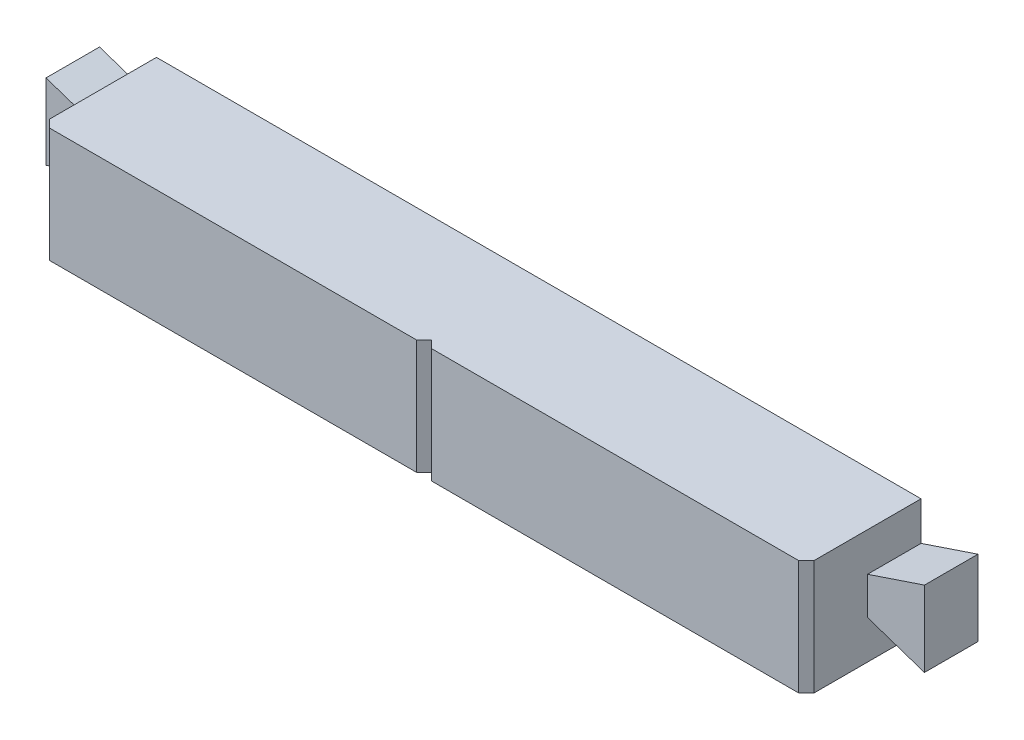
ISO-10303-21;
HEADER;
FILE_DESCRIPTION(('STEP AP214'),'2;1');
FILE_NAME('part.step','',(''),(''),'','','');
FILE_SCHEMA(('AUTOMOTIVE_DESIGN { 1 0 10303 214 1 1 1 1 }'));
ENDSEC;
DATA;
#1=APPLICATION_CONTEXT('core data for automotive mechanical design processes');
#2=APPLICATION_PROTOCOL_DEFINITION('international standard','automotive_design',2000,#1);
#3=PRODUCT_CONTEXT('',#1,'mechanical');
#4=PRODUCT('Part','Part','',(#3));
#5=PRODUCT_RELATED_PRODUCT_CATEGORY('part','',(#4));
#6=PRODUCT_DEFINITION_FORMATION('','',#4);
#7=PRODUCT_DEFINITION_CONTEXT('part definition',#1,'design');
#8=PRODUCT_DEFINITION('design','',#6,#7);
#9=PRODUCT_DEFINITION_SHAPE('','',#8);
#10=(LENGTH_UNIT() NAMED_UNIT(*) SI_UNIT(.MILLI.,.METRE.));
#11=(NAMED_UNIT(*) PLANE_ANGLE_UNIT() SI_UNIT($,.RADIAN.));
#12=(NAMED_UNIT(*) SI_UNIT($,.STERADIAN.) SOLID_ANGLE_UNIT());
#13=UNCERTAINTY_MEASURE_WITH_UNIT(LENGTH_MEASURE(1.E-05),#10,'distance_accuracy_value','');
#14=(GEOMETRIC_REPRESENTATION_CONTEXT(3) GLOBAL_UNCERTAINTY_ASSIGNED_CONTEXT((#13)) GLOBAL_UNIT_ASSIGNED_CONTEXT((#10,
#11,#12)) REPRESENTATION_CONTEXT('',''));
#15=CARTESIAN_POINT('',(0.,0.,0.));
#16=DIRECTION('',(0.,0.,1.));
#17=DIRECTION('',(1.,0.,0.));
#18=AXIS2_PLACEMENT_3D('',#15,#16,#17);
#19=CARTESIAN_POINT('',(0.,0.,0.));
#20=DIRECTION('',(0.,0.,-1.));
#21=DIRECTION('',(-1.,0.,0.));
#22=AXIS2_PLACEMENT_3D('',#19,#20,#21);
#23=PLANE('',#22);
#24=DIRECTION('',(0.,-1.,0.));
#25=VECTOR('',#24,1.);
#26=CARTESIAN_POINT('',(-14.4999999999982,0.,0.));
#27=LINE('',#26,#25);
#28=CARTESIAN_POINT('',(-14.4999999999982,6.5,0.));
#29=VERTEX_POINT('',#28);
#30=CARTESIAN_POINT('',(-14.4999999999982,-6.5,0.));
#31=VERTEX_POINT('',#30);
#32=EDGE_CURVE('E524',#29,#31,#27,.T.);
#33=ORIENTED_EDGE('',*,*,#32,.F.);
#34=DIRECTION('',(-1.,0.,0.));
#35=VECTOR('',#34,1.);
#36=CARTESIAN_POINT('',(0.,6.5,0.));
#37=LINE('',#36,#35);
#38=CARTESIAN_POINT('',(-35.5000000000132,6.5,0.));
#39=VERTEX_POINT('',#38);
#40=EDGE_CURVE('E515',#29,#39,#37,.T.);
#41=ORIENTED_EDGE('',*,*,#40,.T.);
#42=DIRECTION('',(0.,1.,0.));
#43=VECTOR('',#42,1.);
#44=CARTESIAN_POINT('',(-35.5000000000132,0.,0.));
#45=LINE('',#44,#43);
#46=CARTESIAN_POINT('',(-35.5000000000132,-6.5,0.));
#47=VERTEX_POINT('',#46);
#48=EDGE_CURVE('E509',#47,#39,#45,.T.);
#49=ORIENTED_EDGE('',*,*,#48,.F.);
#50=DIRECTION('',(-1.,0.,0.));
#51=VECTOR('',#50,1.);
#52=CARTESIAN_POINT('',(0.,-6.5,0.));
#53=LINE('',#52,#51);
#54=CARTESIAN_POINT('',(-34.49999999998,-6.5,0.));
#55=VERTEX_POINT('',#54);
#56=EDGE_CURVE('E502',#55,#47,#53,.T.);
#57=ORIENTED_EDGE('',*,*,#56,.F.);
#58=DIRECTION('',(0.,-1.,0.));
#59=VECTOR('',#58,1.);
#60=CARTESIAN_POINT('',(-34.49999999998,0.,0.));
#61=LINE('',#60,#59);
#62=CARTESIAN_POINT('',(-34.49999999998,5.5,0.));
#63=VERTEX_POINT('',#62);
#64=EDGE_CURVE('E512',#63,#55,#61,.T.);
#65=ORIENTED_EDGE('',*,*,#64,.F.);
#66=DIRECTION('',(-1.,0.,0.));
#67=VECTOR('',#66,1.);
#68=CARTESIAN_POINT('',(-15.4999999999745,5.5,0.));
#69=LINE('',#68,#67);
#70=CARTESIAN_POINT('',(-15.4999999999745,5.5,0.));
#71=VERTEX_POINT('',#70);
#72=EDGE_CURVE('E269',#71,#63,#69,.T.);
#73=ORIENTED_EDGE('',*,*,#72,.F.);
#74=DIRECTION('',(0.,1.,0.));
#75=VECTOR('',#74,1.);
#76=CARTESIAN_POINT('',(-15.4999999999745,0.,0.));
#77=LINE('',#76,#75);
#78=CARTESIAN_POINT('',(-15.4999999999745,-6.5,0.));
#79=VERTEX_POINT('',#78);
#80=EDGE_CURVE('E278',#79,#71,#77,.T.);
#81=ORIENTED_EDGE('',*,*,#80,.F.);
#82=DIRECTION('',(-1.,0.,0.));
#83=VECTOR('',#82,1.);
#84=CARTESIAN_POINT('',(0.,-6.5,0.));
#85=LINE('',#84,#83);
#86=EDGE_CURVE('E519',#31,#79,#85,.T.);
#87=ORIENTED_EDGE('',*,*,#86,.F.);
#88=EDGE_LOOP('',(#33,#41,#49,#57,#65,#73,#81,#87));
#89=FACE_BOUND('',#88,.T.);
#90=DIRECTION('',(0.,-1.,0.));
#91=VECTOR('',#90,1.);
#92=CARTESIAN_POINT('',(35.5000000000132,0.,0.));
#93=LINE('',#92,#91);
#94=CARTESIAN_POINT('',(35.5000000000132,6.5,0.));
#95=VERTEX_POINT('',#94);
#96=CARTESIAN_POINT('',(35.5000000000132,-6.5,0.));
#97=VERTEX_POINT('',#96);
#98=EDGE_CURVE('E11',#95,#97,#93,.T.);
#99=ORIENTED_EDGE('',*,*,#98,.F.);
#100=DIRECTION('',(-1.,0.,0.));
#101=VECTOR('',#100,1.);
#102=CARTESIAN_POINT('',(0.,6.5,0.));
#103=LINE('',#102,#101);
#104=CARTESIAN_POINT('',(14.4999999999982,6.5,0.));
#105=VERTEX_POINT('',#104);
#106=EDGE_CURVE('E536',#95,#105,#103,.T.);
#107=ORIENTED_EDGE('',*,*,#106,.T.);
#108=DIRECTION('',(0.,1.,0.));
#109=VECTOR('',#108,1.);
#110=CARTESIAN_POINT('',(14.4999999999982,0.,0.));
#111=LINE('',#110,#109);
#112=CARTESIAN_POINT('',(14.4999999999982,-6.5,0.));
#113=VERTEX_POINT('',#112);
#114=EDGE_CURVE('E531',#113,#105,#111,.T.);
#115=ORIENTED_EDGE('',*,*,#114,.F.);
#116=DIRECTION('',(-1.,0.,0.));
#117=VECTOR('',#116,1.);
#118=CARTESIAN_POINT('',(0.,-6.5,0.));
#119=LINE('',#118,#117);
#120=CARTESIAN_POINT('',(15.4999999999745,-6.5,0.));
#121=VERTEX_POINT('',#120);
#122=EDGE_CURVE('E528',#121,#113,#119,.T.);
#123=ORIENTED_EDGE('',*,*,#122,.F.);
#124=DIRECTION('',(0.,-1.,0.));
#125=VECTOR('',#124,1.);
#126=CARTESIAN_POINT('',(15.4999999999745,0.,0.));
#127=LINE('',#126,#125);
#128=CARTESIAN_POINT('',(15.4999999999745,5.5,0.));
#129=VERTEX_POINT('',#128);
#130=EDGE_CURVE('E65',#129,#121,#127,.T.);
#131=ORIENTED_EDGE('',*,*,#130,.F.);
#132=DIRECTION('',(-1.,0.,0.));
#133=VECTOR('',#132,1.);
#134=CARTESIAN_POINT('',(34.49999999998,5.5,0.));
#135=LINE('',#134,#133);
#136=CARTESIAN_POINT('',(34.49999999998,5.5,0.));
#137=VERTEX_POINT('',#136);
#138=EDGE_CURVE('E558',#137,#129,#135,.T.);
#139=ORIENTED_EDGE('',*,*,#138,.F.);
#140=DIRECTION('',(0.,1.,0.));
#141=VECTOR('',#140,1.);
#142=CARTESIAN_POINT('',(34.49999999998,0.,0.));
#143=LINE('',#142,#141);
#144=CARTESIAN_POINT('',(34.49999999998,-6.5,0.));
#145=VERTEX_POINT('',#144);
#146=EDGE_CURVE('E51',#145,#137,#143,.T.);
#147=ORIENTED_EDGE('',*,*,#146,.F.);
#148=DIRECTION('',(-1.,0.,0.));
#149=VECTOR('',#148,1.);
#150=CARTESIAN_POINT('',(0.,-6.5,0.));
#151=LINE('',#150,#149);
#152=EDGE_CURVE('E540',#97,#145,#151,.T.);
#153=ORIENTED_EDGE('',*,*,#152,.F.);
#154=EDGE_LOOP('',(#99,#107,#115,#123,#131,#139,#147,#153));
#155=FACE_BOUND('',#154,.T.);
#156=DIRECTION('',(0.,1.,0.));
#157=VECTOR('',#156,1.);
#158=CARTESIAN_POINT('',(50.,-7.5,0.));
#159=LINE('',#158,#157);
#160=CARTESIAN_POINT('',(50.,-7.5,0.));
#161=VERTEX_POINT('',#160);
#162=CARTESIAN_POINT('',(50.,-2.44999999999999,0.));
#163=VERTEX_POINT('',#162);
#164=EDGE_CURVE('E434',#161,#163,#159,.T.);
#165=ORIENTED_EDGE('',*,*,#164,.F.);
#166=DIRECTION('',(1.,0.,0.));
#167=VECTOR('',#166,1.);
#168=CARTESIAN_POINT('',(-50.,-7.5,0.));
#169=LINE('',#168,#167);
#170=CARTESIAN_POINT('',(-50.,-7.5,0.));
#171=VERTEX_POINT('',#170);
#172=EDGE_CURVE('E447',#171,#161,#169,.T.);
#173=ORIENTED_EDGE('',*,*,#172,.F.);
#174=DIRECTION('',(0.,-1.,0.));
#175=VECTOR('',#174,1.);
#176=CARTESIAN_POINT('',(-50.,-7.5,0.));
#177=LINE('',#176,#175);
#178=CARTESIAN_POINT('',(-50.,-2.45,0.));
#179=VERTEX_POINT('',#178);
#180=EDGE_CURVE('E442',#179,#171,#177,.T.);
#181=ORIENTED_EDGE('',*,*,#180,.F.);
#182=DIRECTION('',(0.948045105831673,0.318135941554253,0.));
#183=VECTOR('',#182,1.);
#184=CARTESIAN_POINT('',(-57.45,-4.95,0.));
#185=LINE('',#184,#183);
#186=CARTESIAN_POINT('',(-57.45,-4.95,0.));
#187=VERTEX_POINT('',#186);
#188=EDGE_CURVE('E390',#187,#179,#185,.T.);
#189=ORIENTED_EDGE('',*,*,#188,.F.);
#190=DIRECTION('',(0.,-1.,0.));
#191=VECTOR('',#190,1.);
#192=CARTESIAN_POINT('',(-57.45,0.,0.));
#193=LINE('',#192,#191);
#194=CARTESIAN_POINT('',(-57.45,4.95,0.));
#195=VERTEX_POINT('',#194);
#196=EDGE_CURVE('E403',#195,#187,#193,.T.);
#197=ORIENTED_EDGE('',*,*,#196,.F.);
#198=DIRECTION('',(-0.948045105831674,0.318135941554253,0.));
#199=VECTOR('',#198,1.);
#200=CARTESIAN_POINT('',(-50.,2.45,0.));
#201=LINE('',#200,#199);
#202=CARTESIAN_POINT('',(-50.,2.45,0.));
#203=VERTEX_POINT('',#202);
#204=EDGE_CURVE('E385',#203,#195,#201,.T.);
#205=ORIENTED_EDGE('',*,*,#204,.F.);
#206=CARTESIAN_POINT('',(-50.,7.5,0.));
#207=VERTEX_POINT('',#206);
#208=EDGE_CURVE('E443',#207,#203,#177,.T.);
#209=ORIENTED_EDGE('',*,*,#208,.F.);
#210=DIRECTION('',(-1.,0.,0.));
#211=VECTOR('',#210,1.);
#212=CARTESIAN_POINT('',(-50.,7.5,0.));
#213=LINE('',#212,#211);
#214=CARTESIAN_POINT('',(50.,7.5,0.));
#215=VERTEX_POINT('',#214);
#216=EDGE_CURVE('E438',#215,#207,#213,.T.);
#217=ORIENTED_EDGE('',*,*,#216,.F.);
#218=CARTESIAN_POINT('',(50.,2.45000000000001,0.));
#219=VERTEX_POINT('',#218);
#220=EDGE_CURVE('E422',#219,#215,#159,.T.);
#221=ORIENTED_EDGE('',*,*,#220,.F.);
#222=DIRECTION('',(-0.948045105831673,-0.318135941554253,0.));
#223=VECTOR('',#222,1.);
#224=CARTESIAN_POINT('',(50.,2.45000000000001,0.));
#225=LINE('',#224,#223);
#226=CARTESIAN_POINT('',(57.45,4.95000000000001,0.));
#227=VERTEX_POINT('',#226);
#228=EDGE_CURVE('E353',#227,#219,#225,.T.);
#229=ORIENTED_EDGE('',*,*,#228,.F.);
#230=DIRECTION('',(0.,1.,0.));
#231=VECTOR('',#230,1.);
#232=CARTESIAN_POINT('',(57.45,4.95000000000001,0.));
#233=LINE('',#232,#231);
#234=CARTESIAN_POINT('',(57.45,-4.94999999999999,0.));
#235=VERTEX_POINT('',#234);
#236=EDGE_CURVE('E366',#235,#227,#233,.T.);
#237=ORIENTED_EDGE('',*,*,#236,.F.);
#238=DIRECTION('',(0.948045105831674,-0.318135941554253,0.));
#239=VECTOR('',#238,1.);
#240=CARTESIAN_POINT('',(57.45,-4.94999999999999,0.));
#241=LINE('',#240,#239);
#242=EDGE_CURVE('E337',#163,#235,#241,.T.);
#243=ORIENTED_EDGE('',*,*,#242,.F.);
#244=EDGE_LOOP('',(#165,#173,#181,#189,#197,#205,#209,#217,#221,#229,#237,#243));
#245=FACE_BOUND('',#244,.T.);
#246=ADVANCED_FACE('F41',(#89,#155,#245),#23,.T.);
#247=CARTESIAN_POINT('',(0.,0.,15.));
#248=DIRECTION('',(0.,0.,-1.));
#249=DIRECTION('',(-1.,0.,0.));
#250=AXIS2_PLACEMENT_3D('',#247,#248,#249);
#251=PLANE('',#250);
#252=DIRECTION('',(-1.,0.,0.));
#253=VECTOR('',#252,1.);
#254=CARTESIAN_POINT('',(-50.,7.5,15.));
#255=LINE('',#254,#253);
#256=CARTESIAN_POINT('',(49.,7.5,15.));
#257=VERTEX_POINT('',#256);
#258=CARTESIAN_POINT('',(1.,7.5,15.));
#259=VERTEX_POINT('',#258);
#260=EDGE_CURVE('E423',#257,#259,#255,.T.);
#261=ORIENTED_EDGE('',*,*,#260,.T.);
#262=DIRECTION('',(0.,1.,0.));
#263=VECTOR('',#262,1.);
#264=CARTESIAN_POINT('',(1.,-7.5,15.));
#265=LINE('',#264,#263);
#266=CARTESIAN_POINT('',(1.,-7.5,15.));
#267=VERTEX_POINT('',#266);
#268=EDGE_CURVE('E323',#267,#259,#265,.T.);
#269=ORIENTED_EDGE('',*,*,#268,.F.);
#270=DIRECTION('',(1.,0.,0.));
#271=VECTOR('',#270,1.);
#272=CARTESIAN_POINT('',(-50.,-7.5,15.));
#273=LINE('',#272,#271);
#274=CARTESIAN_POINT('',(49.,-7.5,15.));
#275=VERTEX_POINT('',#274);
#276=EDGE_CURVE('E427',#267,#275,#273,.T.);
#277=ORIENTED_EDGE('',*,*,#276,.T.);
#278=DIRECTION('',(0.,1.,0.));
#279=VECTOR('',#278,1.);
#280=CARTESIAN_POINT('',(49.,0.,15.));
#281=LINE('',#280,#279);
#282=EDGE_CURVE('E462',#275,#257,#281,.T.);
#283=ORIENTED_EDGE('',*,*,#282,.T.);
#284=EDGE_LOOP('',(#261,#269,#277,#283));
#285=FACE_BOUND('',#284,.T.);
#286=ADVANCED_FACE('F660',(#285),#251,.F.);
#287=CARTESIAN_POINT('',(50.,-7.5,15.));
#288=DIRECTION('',(-1.,0.,0.));
#289=DIRECTION('',(0.,0.,1.));
#290=AXIS2_PLACEMENT_3D('',#287,#288,#289);
#291=PLANE('',#290);
#292=DIRECTION('',(0.,0.,-1.));
#293=VECTOR('',#292,1.);
#294=CARTESIAN_POINT('',(50.,7.5,15.));
#295=LINE('',#294,#293);
#296=CARTESIAN_POINT('',(50.,7.5,14.));
#297=VERTEX_POINT('',#296);
#298=EDGE_CURVE('E459',#297,#215,#295,.T.);
#299=ORIENTED_EDGE('',*,*,#298,.F.);
#300=DIRECTION('',(0.,-1.,0.));
#301=VECTOR('',#300,1.);
#302=CARTESIAN_POINT('',(50.,-7.5,14.));
#303=LINE('',#302,#301);
#304=CARTESIAN_POINT('',(50.,-7.5,14.));
#305=VERTEX_POINT('',#304);
#306=EDGE_CURVE('E487',#297,#305,#303,.T.);
#307=ORIENTED_EDGE('',*,*,#306,.T.);
#308=DIRECTION('',(0.,0.,-1.));
#309=VECTOR('',#308,1.);
#310=CARTESIAN_POINT('',(50.,-7.5,15.));
#311=LINE('',#310,#309);
#312=EDGE_CURVE('E433',#305,#161,#311,.T.);
#313=ORIENTED_EDGE('',*,*,#312,.T.);
#314=ORIENTED_EDGE('',*,*,#164,.T.);
#315=DIRECTION('',(0.,0.,-1.));
#316=VECTOR('',#315,1.);
#317=CARTESIAN_POINT('',(50.,-2.44999999999999,7.));
#318=LINE('',#317,#316);
#319=CARTESIAN_POINT('',(50.,-2.44999999999999,7.));
#320=VERTEX_POINT('',#319);
#321=EDGE_CURVE('E382',#320,#163,#318,.T.);
#322=ORIENTED_EDGE('',*,*,#321,.F.);
#323=DIRECTION('',(0.,-1.,0.));
#324=VECTOR('',#323,1.);
#325=CARTESIAN_POINT('',(50.,0.,7.));
#326=LINE('',#325,#324);
#327=CARTESIAN_POINT('',(50.,2.45000000000001,7.));
#328=VERTEX_POINT('',#327);
#329=EDGE_CURVE('E349',#328,#320,#326,.T.);
#330=ORIENTED_EDGE('',*,*,#329,.F.);
#331=DIRECTION('',(0.,0.,-1.));
#332=VECTOR('',#331,1.);
#333=CARTESIAN_POINT('',(50.,2.45000000000001,7.));
#334=LINE('',#333,#332);
#335=EDGE_CURVE('E362',#328,#219,#334,.T.);
#336=ORIENTED_EDGE('',*,*,#335,.T.);
#337=ORIENTED_EDGE('',*,*,#220,.T.);
#338=EDGE_LOOP('',(#299,#307,#313,#314,#322,#330,#336,#337));
#339=FACE_BOUND('',#338,.T.);
#340=ADVANCED_FACE('F665',(#339),#291,.F.);
#341=CARTESIAN_POINT('',(-50.,-7.5,15.));
#342=DIRECTION('',(1.,0.,0.));
#343=DIRECTION('',(0.,0.,-1.));
#344=AXIS2_PLACEMENT_3D('',#341,#342,#343);
#345=PLANE('',#344);
#346=DIRECTION('',(0.,0.,-1.));
#347=VECTOR('',#346,1.);
#348=CARTESIAN_POINT('',(-50.,-7.5,15.));
#349=LINE('',#348,#347);
#350=CARTESIAN_POINT('',(-50.,-7.5,14.));
#351=VERTEX_POINT('',#350);
#352=EDGE_CURVE('E453',#351,#171,#349,.T.);
#353=ORIENTED_EDGE('',*,*,#352,.F.);
#354=DIRECTION('',(0.,1.,0.));
#355=VECTOR('',#354,1.);
#356=CARTESIAN_POINT('',(-50.,-7.5,14.));
#357=LINE('',#356,#355);
#358=CARTESIAN_POINT('',(-50.,7.5,14.));
#359=VERTEX_POINT('',#358);
#360=EDGE_CURVE('E477',#351,#359,#357,.T.);
#361=ORIENTED_EDGE('',*,*,#360,.T.);
#362=DIRECTION('',(0.,0.,-1.));
#363=VECTOR('',#362,1.);
#364=CARTESIAN_POINT('',(-50.,7.5,15.));
#365=LINE('',#364,#363);
#366=EDGE_CURVE('E456',#359,#207,#365,.T.);
#367=ORIENTED_EDGE('',*,*,#366,.T.);
#368=ORIENTED_EDGE('',*,*,#208,.T.);
#369=DIRECTION('',(0.,0.,-1.));
#370=VECTOR('',#369,1.);
#371=CARTESIAN_POINT('',(-50.,2.45,7.));
#372=LINE('',#371,#370);
#373=CARTESIAN_POINT('',(-50.,2.45,7.));
#374=VERTEX_POINT('',#373);
#375=EDGE_CURVE('E419',#374,#203,#372,.T.);
#376=ORIENTED_EDGE('',*,*,#375,.F.);
#377=DIRECTION('',(0.,1.,0.));
#378=VECTOR('',#377,1.);
#379=CARTESIAN_POINT('',(-50.,-2.45,7.));
#380=LINE('',#379,#378);
#381=CARTESIAN_POINT('',(-50.,-2.45,7.));
#382=VERTEX_POINT('',#381);
#383=EDGE_CURVE('E386',#382,#374,#380,.T.);
#384=ORIENTED_EDGE('',*,*,#383,.F.);
#385=DIRECTION('',(0.,0.,-1.));
#386=VECTOR('',#385,1.);
#387=CARTESIAN_POINT('',(-50.,-2.45,7.));
#388=LINE('',#387,#386);
#389=EDGE_CURVE('E399',#382,#179,#388,.T.);
#390=ORIENTED_EDGE('',*,*,#389,.T.);
#391=ORIENTED_EDGE('',*,*,#180,.T.);
#392=EDGE_LOOP('',(#353,#361,#367,#368,#376,#384,#390,#391));
#393=FACE_BOUND('',#392,.T.);
#394=ADVANCED_FACE('F676',(#393),#345,.F.);
#395=CARTESIAN_POINT('',(-50.,7.5,15.));
#396=DIRECTION('',(0.,-1.,0.));
#397=DIRECTION('',(0.,0.,-1.));
#398=AXIS2_PLACEMENT_3D('',#395,#396,#397);
#399=PLANE('',#398);
#400=CARTESIAN_POINT('',(-1.,7.5,15.));
#401=VERTEX_POINT('',#400);
#402=CARTESIAN_POINT('',(-49.,7.5,15.));
#403=VERTEX_POINT('',#402);
#404=EDGE_CURVE('E428',#401,#403,#255,.T.);
#405=ORIENTED_EDGE('',*,*,#404,.F.);
#406=DIRECTION('',(-0.70710678118655,0.,0.707106781186545));
#407=VECTOR('',#406,1.);
#408=CARTESIAN_POINT('',(-25.5000000000002,7.5,39.5));
#409=LINE('',#408,#407);
#410=CARTESIAN_POINT('',(0.,7.5,14.));
#411=VERTEX_POINT('',#410);
#412=EDGE_CURVE('E499',#401,#411,#409,.F.);
#413=ORIENTED_EDGE('',*,*,#412,.T.);
#414=DIRECTION('',(-0.70710678118655,0.,-0.707106781186545));
#415=VECTOR('',#414,1.);
#416=CARTESIAN_POINT('',(-24.5000000000002,7.5,-10.5));
#417=LINE('',#416,#415);
#418=EDGE_CURVE('E490',#411,#259,#417,.F.);
#419=ORIENTED_EDGE('',*,*,#418,.T.);
#420=ORIENTED_EDGE('',*,*,#260,.F.);
#421=DIRECTION('',(-0.707106781186543,0.,0.707106781186552));
#422=VECTOR('',#421,1.);
#423=CARTESIAN_POINT('',(49.,7.5,15.));
#424=LINE('',#423,#422);
#425=EDGE_CURVE('E480',#257,#297,#424,.F.);
#426=ORIENTED_EDGE('',*,*,#425,.T.);
#427=ORIENTED_EDGE('',*,*,#298,.T.);
#428=ORIENTED_EDGE('',*,*,#216,.T.);
#429=ORIENTED_EDGE('',*,*,#366,.F.);
#430=DIRECTION('',(-0.707106781186543,0.,-0.707106781186552));
#431=VECTOR('',#430,1.);
#432=CARTESIAN_POINT('',(-49.,7.5,15.));
#433=LINE('',#432,#431);
#434=EDGE_CURVE('E483',#359,#403,#433,.F.);
#435=ORIENTED_EDGE('',*,*,#434,.T.);
#436=EDGE_LOOP('',(#405,#413,#419,#420,#426,#427,#428,#429,#435));
#437=FACE_BOUND('',#436,.T.);
#438=ADVANCED_FACE('F674',(#437),#399,.F.);
#439=CARTESIAN_POINT('',(-50.,-7.5,15.));
#440=DIRECTION('',(0.,1.,0.));
#441=DIRECTION('',(0.,0.,1.));
#442=AXIS2_PLACEMENT_3D('',#439,#440,#441);
#443=PLANE('',#442);
#444=ORIENTED_EDGE('',*,*,#276,.F.);
#445=DIRECTION('',(0.70710678118655,0.,0.707106781186545));
#446=VECTOR('',#445,1.);
#447=CARTESIAN_POINT('',(-24.5000000000002,-7.5,-10.5));
#448=LINE('',#447,#446);
#449=CARTESIAN_POINT('',(0.,-7.5,14.));
#450=VERTEX_POINT('',#449);
#451=EDGE_CURVE('E493',#267,#450,#448,.F.);
#452=ORIENTED_EDGE('',*,*,#451,.T.);
#453=DIRECTION('',(0.70710678118655,0.,-0.707106781186545));
#454=VECTOR('',#453,1.);
#455=CARTESIAN_POINT('',(-25.5000000000002,-7.5,39.5));
#456=LINE('',#455,#454);
#457=CARTESIAN_POINT('',(-1.,-7.5,15.));
#458=VERTEX_POINT('',#457);
#459=EDGE_CURVE('E496',#450,#458,#456,.F.);
#460=ORIENTED_EDGE('',*,*,#459,.T.);
#461=CARTESIAN_POINT('',(-49.,-7.5,15.));
#462=VERTEX_POINT('',#461);
#463=EDGE_CURVE('E429',#462,#458,#273,.T.);
#464=ORIENTED_EDGE('',*,*,#463,.F.);
#465=DIRECTION('',(0.707106781186543,0.,0.707106781186552));
#466=VECTOR('',#465,1.);
#467=CARTESIAN_POINT('',(-49.,-7.5,15.));
#468=LINE('',#467,#466);
#469=EDGE_CURVE('E474',#462,#351,#468,.F.);
#470=ORIENTED_EDGE('',*,*,#469,.T.);
#471=ORIENTED_EDGE('',*,*,#352,.T.);
#472=ORIENTED_EDGE('',*,*,#172,.T.);
#473=ORIENTED_EDGE('',*,*,#312,.F.);
#474=DIRECTION('',(0.707106781186543,0.,-0.707106781186552));
#475=VECTOR('',#474,1.);
#476=CARTESIAN_POINT('',(49.,-7.5,15.));
#477=LINE('',#476,#475);
#478=EDGE_CURVE('E470',#305,#275,#477,.F.);
#479=ORIENTED_EDGE('',*,*,#478,.T.);
#480=EDGE_LOOP('',(#444,#452,#460,#464,#470,#471,#472,#473,#479));
#481=FACE_BOUND('',#480,.T.);
#482=CARTESIAN_POINT('',(-25.,-7.5,5.75));
#483=DIRECTION('',(0.,-1.,0.));
#484=DIRECTION('',(0.,0.,-1.));
#485=AXIS2_PLACEMENT_3D('',#482,#483,#484);
#486=CIRCLE('',#485,2.5);
#487=CARTESIAN_POINT('',(-25.,-7.5,3.25));
#488=VERTEX_POINT('',#487);
#489=EDGE_CURVE('E338',#488,#488,#486,.T.);
#490=ORIENTED_EDGE('',*,*,#489,.F.);
#491=EDGE_LOOP('',(#490));
#492=FACE_BOUND('',#491,.T.);
#493=CARTESIAN_POINT('',(25.,-7.5,5.75));
#494=DIRECTION('',(0.,-1.,0.));
#495=DIRECTION('',(0.,0.,-1.));
#496=AXIS2_PLACEMENT_3D('',#493,#494,#495);
#497=CIRCLE('',#496,2.5);
#498=CARTESIAN_POINT('',(25.,-7.5,3.25));
#499=VERTEX_POINT('',#498);
#500=EDGE_CURVE('E332',#499,#499,#497,.T.);
#501=ORIENTED_EDGE('',*,*,#500,.F.);
#502=EDGE_LOOP('',(#501));
#503=FACE_BOUND('',#502,.T.);
#504=ADVANCED_FACE('F671',(#481,#492,#503),#443,.F.);
#505=ORIENTED_EDGE('',*,*,#463,.T.);
#506=DIRECTION('',(0.,-1.,0.));
#507=VECTOR('',#506,1.);
#508=CARTESIAN_POINT('',(-1.,-7.5,15.));
#509=LINE('',#508,#507);
#510=EDGE_CURVE('E327',#401,#458,#509,.T.);
#511=ORIENTED_EDGE('',*,*,#510,.F.);
#512=ORIENTED_EDGE('',*,*,#404,.T.);
#513=DIRECTION('',(0.,-1.,0.));
#514=VECTOR('',#513,1.);
#515=CARTESIAN_POINT('',(-49.,0.,15.));
#516=LINE('',#515,#514);
#517=EDGE_CURVE('E466',#403,#462,#516,.T.);
#518=ORIENTED_EDGE('',*,*,#517,.T.);
#519=EDGE_LOOP('',(#505,#511,#512,#518));
#520=FACE_BOUND('',#519,.T.);
#521=ADVANCED_FACE('F668',(#520),#251,.F.);
#522=CARTESIAN_POINT('',(-50.,2.45,7.));
#523=DIRECTION('',(-0.318135941554253,-0.948045105831673,0.));
#524=DIRECTION('',(0.948045105831674,-0.318135941554253,0.));
#525=AXIS2_PLACEMENT_3D('',#522,#523,#524);
#526=PLANE('',#525);
#527=ORIENTED_EDGE('',*,*,#204,.T.);
#528=DIRECTION('',(0.,0.,-1.));
#529=VECTOR('',#528,1.);
#530=CARTESIAN_POINT('',(-57.45,4.95,7.));
#531=LINE('',#530,#529);
#532=CARTESIAN_POINT('',(-57.45,4.95,7.));
#533=VERTEX_POINT('',#532);
#534=EDGE_CURVE('E415',#533,#195,#531,.T.);
#535=ORIENTED_EDGE('',*,*,#534,.F.);
#536=DIRECTION('',(-0.948045105831674,0.318135941554253,0.));
#537=VECTOR('',#536,1.);
#538=CARTESIAN_POINT('',(-50.,2.45,7.));
#539=LINE('',#538,#537);
#540=EDGE_CURVE('E389',#374,#533,#539,.T.);
#541=ORIENTED_EDGE('',*,*,#540,.F.);
#542=ORIENTED_EDGE('',*,*,#375,.T.);
#543=EDGE_LOOP('',(#527,#535,#541,#542));
#544=FACE_BOUND('',#543,.T.);
#545=ADVANCED_FACE('F780',(#544),#526,.F.);
#546=CARTESIAN_POINT('',(-57.45,0.,7.));
#547=DIRECTION('',(1.,0.,0.));
#548=DIRECTION('',(0.,0.,-1.));
#549=AXIS2_PLACEMENT_3D('',#546,#547,#548);
#550=PLANE('',#549);
#551=ORIENTED_EDGE('',*,*,#196,.T.);
#552=DIRECTION('',(0.,0.,-1.));
#553=VECTOR('',#552,1.);
#554=CARTESIAN_POINT('',(-57.45,-4.95,7.));
#555=LINE('',#554,#553);
#556=CARTESIAN_POINT('',(-57.45,-4.95,7.));
#557=VERTEX_POINT('',#556);
#558=EDGE_CURVE('E411',#557,#187,#555,.T.);
#559=ORIENTED_EDGE('',*,*,#558,.F.);
#560=DIRECTION('',(0.,-1.,0.));
#561=VECTOR('',#560,1.);
#562=CARTESIAN_POINT('',(-57.45,4.95,7.));
#563=LINE('',#562,#561);
#564=EDGE_CURVE('E393',#533,#557,#563,.T.);
#565=ORIENTED_EDGE('',*,*,#564,.F.);
#566=ORIENTED_EDGE('',*,*,#534,.T.);
#567=EDGE_LOOP('',(#551,#559,#565,#566));
#568=FACE_BOUND('',#567,.T.);
#569=ADVANCED_FACE('F777',(#568),#550,.F.);
#570=CARTESIAN_POINT('',(-57.45,-4.95,7.));
#571=DIRECTION('',(-0.318135941554253,0.948045105831673,0.));
#572=DIRECTION('',(-0.948045105831674,-0.318135941554253,0.));
#573=AXIS2_PLACEMENT_3D('',#570,#571,#572);
#574=PLANE('',#573);
#575=ORIENTED_EDGE('',*,*,#188,.T.);
#576=ORIENTED_EDGE('',*,*,#389,.F.);
#577=DIRECTION('',(0.948045105831673,0.318135941554253,0.));
#578=VECTOR('',#577,1.);
#579=CARTESIAN_POINT('',(-57.45,-4.95,7.));
#580=LINE('',#579,#578);
#581=EDGE_CURVE('E396',#557,#382,#580,.T.);
#582=ORIENTED_EDGE('',*,*,#581,.F.);
#583=ORIENTED_EDGE('',*,*,#558,.T.);
#584=EDGE_LOOP('',(#575,#576,#582,#583));
#585=FACE_BOUND('',#584,.T.);
#586=ADVANCED_FACE('F773',(#585),#574,.F.);
#587=CARTESIAN_POINT('',(0.,0.,7.));
#588=DIRECTION('',(0.,0.,1.));
#589=DIRECTION('',(1.,0.,0.));
#590=AXIS2_PLACEMENT_3D('',#587,#588,#589);
#591=PLANE('',#590);
#592=ORIENTED_EDGE('',*,*,#383,.T.);
#593=ORIENTED_EDGE('',*,*,#540,.T.);
#594=ORIENTED_EDGE('',*,*,#564,.T.);
#595=ORIENTED_EDGE('',*,*,#581,.T.);
#596=EDGE_LOOP('',(#592,#593,#594,#595));
#597=FACE_BOUND('',#596,.T.);
#598=ADVANCED_FACE('F767',(#597),#591,.T.);
#599=CARTESIAN_POINT('',(57.45,-4.94999999999999,7.));
#600=DIRECTION('',(0.318135941554253,0.948045105831673,0.));
#601=DIRECTION('',(-0.948045105831674,0.318135941554253,0.));
#602=AXIS2_PLACEMENT_3D('',#599,#600,#601);
#603=PLANE('',#602);
#604=ORIENTED_EDGE('',*,*,#242,.T.);
#605=DIRECTION('',(0.,0.,-1.));
#606=VECTOR('',#605,1.);
#607=CARTESIAN_POINT('',(57.45,-4.94999999999999,7.));
#608=LINE('',#607,#606);
#609=CARTESIAN_POINT('',(57.45,-4.94999999999999,7.));
#610=VERTEX_POINT('',#609);
#611=EDGE_CURVE('E378',#610,#235,#608,.T.);
#612=ORIENTED_EDGE('',*,*,#611,.F.);
#613=DIRECTION('',(0.948045105831674,-0.318135941554253,0.));
#614=VECTOR('',#613,1.);
#615=CARTESIAN_POINT('',(57.45,-4.94999999999999,7.));
#616=LINE('',#615,#614);
#617=EDGE_CURVE('E352',#320,#610,#616,.T.);
#618=ORIENTED_EDGE('',*,*,#617,.F.);
#619=ORIENTED_EDGE('',*,*,#321,.T.);
#620=EDGE_LOOP('',(#604,#612,#618,#619));
#621=FACE_BOUND('',#620,.T.);
#622=ADVANCED_FACE('F750',(#621),#603,.F.);
#623=CARTESIAN_POINT('',(57.45,4.95000000000001,7.));
#624=DIRECTION('',(-1.,0.,0.));
#625=DIRECTION('',(0.,0.,1.));
#626=AXIS2_PLACEMENT_3D('',#623,#624,#625);
#627=PLANE('',#626);
#628=ORIENTED_EDGE('',*,*,#236,.T.);
#629=DIRECTION('',(0.,0.,-1.));
#630=VECTOR('',#629,1.);
#631=CARTESIAN_POINT('',(57.45,4.95000000000001,7.));
#632=LINE('',#631,#630);
#633=CARTESIAN_POINT('',(57.45,4.95000000000001,7.));
#634=VERTEX_POINT('',#633);
#635=EDGE_CURVE('E374',#634,#227,#632,.T.);
#636=ORIENTED_EDGE('',*,*,#635,.F.);
#637=DIRECTION('',(0.,1.,0.));
#638=VECTOR('',#637,1.);
#639=CARTESIAN_POINT('',(57.45,0.,7.));
#640=LINE('',#639,#638);
#641=EDGE_CURVE('E356',#610,#634,#640,.T.);
#642=ORIENTED_EDGE('',*,*,#641,.F.);
#643=ORIENTED_EDGE('',*,*,#611,.T.);
#644=EDGE_LOOP('',(#628,#636,#642,#643));
#645=FACE_BOUND('',#644,.T.);
#646=ADVANCED_FACE('F759',(#645),#627,.F.);
#647=CARTESIAN_POINT('',(50.,2.45000000000001,7.));
#648=DIRECTION('',(0.318135941554253,-0.948045105831673,0.));
#649=DIRECTION('',(0.948045105831674,0.318135941554253,0.));
#650=AXIS2_PLACEMENT_3D('',#647,#648,#649);
#651=PLANE('',#650);
#652=ORIENTED_EDGE('',*,*,#228,.T.);
#653=ORIENTED_EDGE('',*,*,#335,.F.);
#654=DIRECTION('',(-0.948045105831673,-0.318135941554253,0.));
#655=VECTOR('',#654,1.);
#656=CARTESIAN_POINT('',(50.,2.45000000000001,7.));
#657=LINE('',#656,#655);
#658=EDGE_CURVE('E359',#634,#328,#657,.T.);
#659=ORIENTED_EDGE('',*,*,#658,.F.);
#660=ORIENTED_EDGE('',*,*,#635,.T.);
#661=EDGE_LOOP('',(#652,#653,#659,#660));
#662=FACE_BOUND('',#661,.T.);
#663=ADVANCED_FACE('F757',(#662),#651,.F.);
#664=CARTESIAN_POINT('',(0.,0.,7.));
#665=DIRECTION('',(0.,0.,-1.));
#666=DIRECTION('',(-1.,0.,0.));
#667=AXIS2_PLACEMENT_3D('',#664,#665,#666);
#668=PLANE('',#667);
#669=ORIENTED_EDGE('',*,*,#329,.T.);
#670=ORIENTED_EDGE('',*,*,#617,.T.);
#671=ORIENTED_EDGE('',*,*,#641,.T.);
#672=ORIENTED_EDGE('',*,*,#658,.T.);
#673=EDGE_LOOP('',(#669,#670,#671,#672));
#674=FACE_BOUND('',#673,.T.);
#675=ADVANCED_FACE('F694',(#674),#668,.F.);
#676=CARTESIAN_POINT('',(-49.,0.,15.));
#677=DIRECTION('',(0.707106781186552,0.,-0.707106781186543));
#678=DIRECTION('',(0.,-1.,0.));
#679=AXIS2_PLACEMENT_3D('',#676,#677,#678);
#680=PLANE('',#679);
#681=ORIENTED_EDGE('',*,*,#434,.F.);
#682=ORIENTED_EDGE('',*,*,#360,.F.);
#683=ORIENTED_EDGE('',*,*,#469,.F.);
#684=ORIENTED_EDGE('',*,*,#517,.F.);
#685=EDGE_LOOP('',(#681,#682,#683,#684));
#686=FACE_BOUND('',#685,.T.);
#687=ADVANCED_FACE('F687',(#686),#680,.F.);
#688=CARTESIAN_POINT('',(49.,0.,15.));
#689=DIRECTION('',(-0.707106781186552,0.,-0.707106781186543));
#690=DIRECTION('',(0.,1.,0.));
#691=AXIS2_PLACEMENT_3D('',#688,#689,#690);
#692=PLANE('',#691);
#693=ORIENTED_EDGE('',*,*,#478,.F.);
#694=ORIENTED_EDGE('',*,*,#306,.F.);
#695=ORIENTED_EDGE('',*,*,#425,.F.);
#696=ORIENTED_EDGE('',*,*,#282,.F.);
#697=EDGE_LOOP('',(#693,#694,#695,#696));
#698=FACE_BOUND('',#697,.T.);
#699=ADVANCED_FACE('F693',(#698),#692,.F.);
#700=CARTESIAN_POINT('',(25.,0.5,5.75));
#701=DIRECTION('',(0.,-1.,0.));
#702=DIRECTION('',(0.,0.,-1.));
#703=AXIS2_PLACEMENT_3D('',#700,#701,#702);
#704=CYLINDRICAL_SURFACE('',#703,2.5);
#705=CARTESIAN_POINT('',(25.,0.5,5.75));
#706=DIRECTION('',(0.,-1.,0.));
#707=DIRECTION('',(0.,0.,-1.));
#708=AXIS2_PLACEMENT_3D('',#705,#706,#707);
#709=CIRCLE('',#708,2.5);
#710=CARTESIAN_POINT('',(25.,0.5,3.25));
#711=VERTEX_POINT('',#710);
#712=EDGE_CURVE('E342',#711,#711,#709,.T.);
#713=ORIENTED_EDGE('',*,*,#712,.F.);
#714=EDGE_LOOP('',(#713));
#715=FACE_BOUND('',#714,.T.);
#716=ORIENTED_EDGE('',*,*,#500,.T.);
#717=EDGE_LOOP('',(#716));
#718=FACE_BOUND('',#717,.T.);
#719=ADVANCED_FACE('F699',(#715,#718),#704,.F.);
#720=CARTESIAN_POINT('',(25.,0.5,5.75));
#721=DIRECTION('',(0.,-1.,0.));
#722=DIRECTION('',(0.,0.,-1.));
#723=AXIS2_PLACEMENT_3D('',#720,#721,#722);
#724=PLANE('',#723);
#725=ORIENTED_EDGE('',*,*,#712,.T.);
#726=EDGE_LOOP('',(#725));
#727=FACE_BOUND('',#726,.T.);
#728=ADVANCED_FACE('F846',(#727),#724,.T.);
#729=CARTESIAN_POINT('',(-25.,0.5,5.75));
#730=DIRECTION('',(0.,-1.,0.));
#731=DIRECTION('',(0.,0.,-1.));
#732=AXIS2_PLACEMENT_3D('',#729,#730,#731);
#733=CYLINDRICAL_SURFACE('',#732,2.5);
#734=CARTESIAN_POINT('',(-25.,0.5,5.75));
#735=DIRECTION('',(0.,-1.,0.));
#736=DIRECTION('',(0.,0.,-1.));
#737=AXIS2_PLACEMENT_3D('',#734,#735,#736);
#738=CIRCLE('',#737,2.5);
#739=CARTESIAN_POINT('',(-25.,0.5,3.25));
#740=VERTEX_POINT('',#739);
#741=EDGE_CURVE('E333',#740,#740,#738,.T.);
#742=ORIENTED_EDGE('',*,*,#741,.F.);
#743=EDGE_LOOP('',(#742));
#744=FACE_BOUND('',#743,.T.);
#745=ORIENTED_EDGE('',*,*,#489,.T.);
#746=EDGE_LOOP('',(#745));
#747=FACE_BOUND('',#746,.T.);
#748=ADVANCED_FACE('F836',(#744,#747),#733,.F.);
#749=CARTESIAN_POINT('',(-25.,0.5,5.75));
#750=DIRECTION('',(0.,-1.,0.));
#751=DIRECTION('',(0.,0.,-1.));
#752=AXIS2_PLACEMENT_3D('',#749,#750,#751);
#753=PLANE('',#752);
#754=ORIENTED_EDGE('',*,*,#741,.T.);
#755=EDGE_LOOP('',(#754));
#756=FACE_BOUND('',#755,.T.);
#757=ADVANCED_FACE('F712',(#756),#753,.T.);
#758=CARTESIAN_POINT('',(1.00000000000002,0.,13.));
#759=DIRECTION('',(0.707106781186545,0.,0.70710678118655));
#760=DIRECTION('',(0.,1.,0.));
#761=AXIS2_PLACEMENT_3D('',#758,#759,#760);
#762=PLANE('',#761);
#763=ORIENTED_EDGE('',*,*,#510,.T.);
#764=ORIENTED_EDGE('',*,*,#459,.F.);
#765=DIRECTION('',(0.,1.,0.));
#766=VECTOR('',#765,1.);
#767=CARTESIAN_POINT('',(0.,0.,14.));
#768=LINE('',#767,#766);
#769=EDGE_CURVE('E328',#411,#450,#768,.F.);
#770=ORIENTED_EDGE('',*,*,#769,.F.);
#771=ORIENTED_EDGE('',*,*,#412,.F.);
#772=EDGE_LOOP('',(#763,#764,#770,#771));
#773=FACE_BOUND('',#772,.T.);
#774=ADVANCED_FACE('F44',(#773),#762,.T.);
#775=CARTESIAN_POINT('',(-1.00000000000002,0.,13.));
#776=DIRECTION('',(-0.707106781186545,0.,0.70710678118655));
#777=DIRECTION('',(0.,-1.,0.));
#778=AXIS2_PLACEMENT_3D('',#775,#776,#777);
#779=PLANE('',#778);
#780=ORIENTED_EDGE('',*,*,#451,.F.);
#781=ORIENTED_EDGE('',*,*,#268,.T.);
#782=ORIENTED_EDGE('',*,*,#418,.F.);
#783=ORIENTED_EDGE('',*,*,#769,.T.);
#784=EDGE_LOOP('',(#780,#781,#782,#783));
#785=FACE_BOUND('',#784,.T.);
#786=ADVANCED_FACE('F702',(#785),#779,.T.);
#787=CARTESIAN_POINT('',(-34.49999999998,6.5,291599.25));
#788=DIRECTION('',(1.,0.,0.));
#789=DIRECTION('',(0.,0.,-1.));
#790=AXIS2_PLACEMENT_3D('',#787,#788,#789);
#791=PLANE('',#790);
#792=DIRECTION('',(0.,-1.,0.));
#793=VECTOR('',#792,1.);
#794=CARTESIAN_POINT('',(-34.49999999998,6.5,13.2500000000277));
#795=LINE('',#794,#793);
#796=CARTESIAN_POINT('',(-34.49999999998,5.5,13.25));
#797=VERTEX_POINT('',#796);
#798=CARTESIAN_POINT('',(-34.49999999998,-6.5,13.2500000000277));
#799=VERTEX_POINT('',#798);
#800=EDGE_CURVE('E304',#797,#799,#795,.T.);
#801=ORIENTED_EDGE('',*,*,#800,.F.);
#802=DIRECTION('',(0.,0.,-1.));
#803=VECTOR('',#802,1.);
#804=CARTESIAN_POINT('',(-34.49999999998,5.5,13.25));
#805=LINE('',#804,#803);
#806=EDGE_CURVE('E264',#797,#63,#805,.T.);
#807=ORIENTED_EDGE('',*,*,#806,.T.);
#808=ORIENTED_EDGE('',*,*,#64,.T.);
#809=DIRECTION('',(0.,0.,1.));
#810=VECTOR('',#809,1.);
#811=CARTESIAN_POINT('',(-34.49999999998,-6.5,291599.25));
#812=LINE('',#811,#810);
#813=EDGE_CURVE('E306',#55,#799,#812,.T.);
#814=ORIENTED_EDGE('',*,*,#813,.T.);
#815=EDGE_LOOP('',(#801,#807,#808,#814));
#816=FACE_BOUND('',#815,.T.);
#817=ADVANCED_FACE('F629',(#816),#791,.F.);
#818=CARTESIAN_POINT('',(-35.5000000000132,6.5,291599.25));
#819=DIRECTION('',(-1.,0.,0.));
#820=DIRECTION('',(0.,0.,1.));
#821=AXIS2_PLACEMENT_3D('',#818,#819,#820);
#822=PLANE('',#821);
#823=ORIENTED_EDGE('',*,*,#48,.T.);
#824=DIRECTION('',(0.,0.,-1.));
#825=VECTOR('',#824,1.);
#826=CARTESIAN_POINT('',(-35.5000000000132,6.5,291599.25));
#827=LINE('',#826,#825);
#828=CARTESIAN_POINT('',(-35.5000000000132,6.5,13.2500000000277));
#829=VERTEX_POINT('',#828);
#830=EDGE_CURVE('E300',#829,#39,#827,.T.);
#831=ORIENTED_EDGE('',*,*,#830,.F.);
#832=DIRECTION('',(0.,-1.,0.));
#833=VECTOR('',#832,1.);
#834=CARTESIAN_POINT('',(-35.5000000000132,6.5,13.2500000000277));
#835=LINE('',#834,#833);
#836=CARTESIAN_POINT('',(-35.5000000000132,-6.5,13.2500000000277));
#837=VERTEX_POINT('',#836);
#838=EDGE_CURVE('E317',#829,#837,#835,.T.);
#839=ORIENTED_EDGE('',*,*,#838,.T.);
#840=DIRECTION('',(0.,0.,-1.));
#841=VECTOR('',#840,1.);
#842=CARTESIAN_POINT('',(-35.5000000000132,-6.5,291599.25));
#843=LINE('',#842,#841);
#844=EDGE_CURVE('E305',#837,#47,#843,.T.);
#845=ORIENTED_EDGE('',*,*,#844,.T.);
#846=EDGE_LOOP('',(#823,#831,#839,#845));
#847=FACE_BOUND('',#846,.T.);
#848=ADVANCED_FACE('F640',(#847),#822,.F.);
#849=CARTESIAN_POINT('',(0.,-6.5,0.));
#850=DIRECTION('',(0.,-1.,0.));
#851=DIRECTION('',(0.,0.,-1.));
#852=AXIS2_PLACEMENT_3D('',#849,#850,#851);
#853=PLANE('',#852);
#854=ORIENTED_EDGE('',*,*,#56,.T.);
#855=ORIENTED_EDGE('',*,*,#844,.F.);
#856=DIRECTION('',(-1.,0.,0.));
#857=VECTOR('',#856,1.);
#858=CARTESIAN_POINT('',(400000.,-6.5,13.2500000000277));
#859=LINE('',#858,#857);
#860=EDGE_CURVE('E310',#799,#837,#859,.T.);
#861=ORIENTED_EDGE('',*,*,#860,.F.);
#862=ORIENTED_EDGE('',*,*,#813,.F.);
#863=EDGE_LOOP('',(#854,#855,#861,#862));
#864=FACE_BOUND('',#863,.T.);
#865=ADVANCED_FACE('F637',(#864),#853,.F.);
#866=CARTESIAN_POINT('',(-14.4999999999982,6.5,291599.25));
#867=DIRECTION('',(1.,0.,0.));
#868=DIRECTION('',(0.,0.,-1.));
#869=AXIS2_PLACEMENT_3D('',#866,#867,#868);
#870=PLANE('',#869);
#871=ORIENTED_EDGE('',*,*,#32,.T.);
#872=DIRECTION('',(0.,0.,1.));
#873=VECTOR('',#872,1.);
#874=CARTESIAN_POINT('',(-14.4999999999982,-6.5,291599.25));
#875=LINE('',#874,#873);
#876=CARTESIAN_POINT('',(-14.4999999999982,-6.5,13.2500000000277));
#877=VERTEX_POINT('',#876);
#878=EDGE_CURVE('E320',#31,#877,#875,.T.);
#879=ORIENTED_EDGE('',*,*,#878,.T.);
#880=DIRECTION('',(0.,-1.,0.));
#881=VECTOR('',#880,1.);
#882=CARTESIAN_POINT('',(-14.4999999999982,6.5,13.2500000000277));
#883=LINE('',#882,#881);
#884=CARTESIAN_POINT('',(-14.4999999999982,6.5,13.2500000000277));
#885=VERTEX_POINT('',#884);
#886=EDGE_CURVE('E288',#885,#877,#883,.T.);
#887=ORIENTED_EDGE('',*,*,#886,.F.);
#888=DIRECTION('',(0.,0.,1.));
#889=VECTOR('',#888,1.);
#890=CARTESIAN_POINT('',(-14.4999999999982,6.5,291599.25));
#891=LINE('',#890,#889);
#892=EDGE_CURVE('E610',#29,#885,#891,.T.);
#893=ORIENTED_EDGE('',*,*,#892,.F.);
#894=EDGE_LOOP('',(#871,#879,#887,#893));
#895=FACE_BOUND('',#894,.T.);
#896=ADVANCED_FACE('F646',(#895),#870,.F.);
#897=CARTESIAN_POINT('',(-15.4999999999745,6.5,291599.25));
#898=DIRECTION('',(-1.,0.,0.));
#899=DIRECTION('',(0.,0.,1.));
#900=AXIS2_PLACEMENT_3D('',#897,#898,#899);
#901=PLANE('',#900);
#902=ORIENTED_EDGE('',*,*,#80,.T.);
#903=DIRECTION('',(0.,0.,-1.));
#904=VECTOR('',#903,1.);
#905=CARTESIAN_POINT('',(-15.4999999999745,5.5,13.25));
#906=LINE('',#905,#904);
#907=CARTESIAN_POINT('',(-15.4999999999745,5.5,13.25));
#908=VERTEX_POINT('',#907);
#909=EDGE_CURVE('E261',#908,#71,#906,.T.);
#910=ORIENTED_EDGE('',*,*,#909,.F.);
#911=DIRECTION('',(0.,-1.,0.));
#912=VECTOR('',#911,1.);
#913=CARTESIAN_POINT('',(-15.4999999999745,6.5,13.2500000000277));
#914=LINE('',#913,#912);
#915=CARTESIAN_POINT('',(-15.4999999999745,-6.5,13.2500000000277));
#916=VERTEX_POINT('',#915);
#917=EDGE_CURVE('E275',#908,#916,#914,.T.);
#918=ORIENTED_EDGE('',*,*,#917,.T.);
#919=DIRECTION('',(0.,0.,-1.));
#920=VECTOR('',#919,1.);
#921=CARTESIAN_POINT('',(-15.4999999999745,-6.5,291599.25));
#922=LINE('',#921,#920);
#923=EDGE_CURVE('E297',#916,#79,#922,.T.);
#924=ORIENTED_EDGE('',*,*,#923,.T.);
#925=EDGE_LOOP('',(#902,#910,#918,#924));
#926=FACE_BOUND('',#925,.T.);
#927=ADVANCED_FACE('F273',(#926),#901,.F.);
#928=CARTESIAN_POINT('',(400000.,6.5,13.2500000000277));
#929=DIRECTION('',(0.,0.,1.));
#930=DIRECTION('',(1.,0.,0.));
#931=AXIS2_PLACEMENT_3D('',#928,#929,#930);
#932=PLANE('',#931);
#933=DIRECTION('',(-1.,0.,0.));
#934=VECTOR('',#933,1.);
#935=CARTESIAN_POINT('',(400000.,-6.5,13.2500000000277));
#936=LINE('',#935,#934);
#937=EDGE_CURVE('E285',#877,#916,#936,.T.);
#938=ORIENTED_EDGE('',*,*,#937,.T.);
#939=ORIENTED_EDGE('',*,*,#917,.F.);
#940=DIRECTION('',(-1.,0.,0.));
#941=VECTOR('',#940,1.);
#942=CARTESIAN_POINT('',(-15.4999999999745,5.5,13.25));
#943=LINE('',#942,#941);
#944=EDGE_CURVE('E258',#908,#797,#943,.T.);
#945=ORIENTED_EDGE('',*,*,#944,.T.);
#946=ORIENTED_EDGE('',*,*,#800,.T.);
#947=ORIENTED_EDGE('',*,*,#860,.T.);
#948=ORIENTED_EDGE('',*,*,#838,.F.);
#949=DIRECTION('',(-1.,0.,0.));
#950=VECTOR('',#949,1.);
#951=CARTESIAN_POINT('',(400000.,6.5,13.2500000000277));
#952=LINE('',#951,#950);
#953=EDGE_CURVE('E294',#885,#829,#952,.T.);
#954=ORIENTED_EDGE('',*,*,#953,.F.);
#955=ORIENTED_EDGE('',*,*,#886,.T.);
#956=EDGE_LOOP('',(#938,#939,#945,#946,#947,#948,#954,#955));
#957=FACE_BOUND('',#956,.T.);
#958=ADVANCED_FACE('F282',(#957),#932,.F.);
#959=CARTESIAN_POINT('',(0.,6.5,0.));
#960=DIRECTION('',(0.,-1.,0.));
#961=DIRECTION('',(0.,0.,-1.));
#962=AXIS2_PLACEMENT_3D('',#959,#960,#961);
#963=PLANE('',#962);
#964=ORIENTED_EDGE('',*,*,#892,.T.);
#965=ORIENTED_EDGE('',*,*,#953,.T.);
#966=ORIENTED_EDGE('',*,*,#830,.T.);
#967=ORIENTED_EDGE('',*,*,#40,.F.);
#968=EDGE_LOOP('',(#964,#965,#966,#967));
#969=FACE_BOUND('',#968,.T.);
#970=ADVANCED_FACE('F643',(#969),#963,.T.);
#971=CARTESIAN_POINT('',(0.,-6.5,0.));
#972=DIRECTION('',(0.,-1.,0.));
#973=DIRECTION('',(0.,0.,-1.));
#974=AXIS2_PLACEMENT_3D('',#971,#972,#973);
#975=PLANE('',#974);
#976=ORIENTED_EDGE('',*,*,#86,.T.);
#977=ORIENTED_EDGE('',*,*,#923,.F.);
#978=ORIENTED_EDGE('',*,*,#937,.F.);
#979=ORIENTED_EDGE('',*,*,#878,.F.);
#980=EDGE_LOOP('',(#976,#977,#978,#979));
#981=FACE_BOUND('',#980,.T.);
#982=ADVANCED_FACE('F647',(#981),#975,.F.);
#983=CARTESIAN_POINT('',(15.4999999999745,6.5,291599.25));
#984=DIRECTION('',(1.,0.,0.));
#985=DIRECTION('',(0.,0.,-1.));
#986=AXIS2_PLACEMENT_3D('',#983,#984,#985);
#987=PLANE('',#986);
#988=DIRECTION('',(0.,-1.,0.));
#989=VECTOR('',#988,1.);
#990=CARTESIAN_POINT('',(15.4999999999745,6.5,13.2500000000277));
#991=LINE('',#990,#989);
#992=CARTESIAN_POINT('',(15.4999999999745,5.5,13.25));
#993=VERTEX_POINT('',#992);
#994=CARTESIAN_POINT('',(15.4999999999745,-6.5,13.2500000000277));
#995=VERTEX_POINT('',#994);
#996=EDGE_CURVE('E597',#993,#995,#991,.T.);
#997=ORIENTED_EDGE('',*,*,#996,.F.);
#998=DIRECTION('',(0.,0.,-1.));
#999=VECTOR('',#998,1.);
#1000=CARTESIAN_POINT('',(15.4999999999745,5.5,13.25));
#1001=LINE('',#1000,#999);
#1002=EDGE_CURVE('E568',#993,#129,#1001,.T.);
#1003=ORIENTED_EDGE('',*,*,#1002,.T.);
#1004=ORIENTED_EDGE('',*,*,#130,.T.);
#1005=DIRECTION('',(0.,0.,1.));
#1006=VECTOR('',#1005,1.);
#1007=CARTESIAN_POINT('',(15.4999999999745,-6.5,291599.25));
#1008=LINE('',#1007,#1006);
#1009=EDGE_CURVE('E287',#121,#995,#1008,.T.);
#1010=ORIENTED_EDGE('',*,*,#1009,.T.);
#1011=EDGE_LOOP('',(#997,#1003,#1004,#1010));
#1012=FACE_BOUND('',#1011,.T.);
#1013=ADVANCED_FACE('F649',(#1012),#987,.F.);
#1014=CARTESIAN_POINT('',(14.4999999999982,6.5,291599.25));
#1015=DIRECTION('',(-1.,0.,0.));
#1016=DIRECTION('',(0.,0.,1.));
#1017=AXIS2_PLACEMENT_3D('',#1014,#1015,#1016);
#1018=PLANE('',#1017);
#1019=ORIENTED_EDGE('',*,*,#114,.T.);
#1020=DIRECTION('',(0.,0.,-1.));
#1021=VECTOR('',#1020,1.);
#1022=CARTESIAN_POINT('',(14.4999999999982,6.5,291599.25));
#1023=LINE('',#1022,#1021);
#1024=CARTESIAN_POINT('',(14.4999999999982,6.5,13.2500000000277));
#1025=VERTEX_POINT('',#1024);
#1026=EDGE_CURVE('E594',#1025,#105,#1023,.T.);
#1027=ORIENTED_EDGE('',*,*,#1026,.F.);
#1028=DIRECTION('',(0.,-1.,0.));
#1029=VECTOR('',#1028,1.);
#1030=CARTESIAN_POINT('',(14.4999999999982,6.5,13.2500000000277));
#1031=LINE('',#1030,#1029);
#1032=CARTESIAN_POINT('',(14.4999999999982,-6.5,13.2500000000277));
#1033=VERTEX_POINT('',#1032);
#1034=EDGE_CURVE('E583',#1025,#1033,#1031,.T.);
#1035=ORIENTED_EDGE('',*,*,#1034,.T.);
#1036=DIRECTION('',(0.,0.,-1.));
#1037=VECTOR('',#1036,1.);
#1038=CARTESIAN_POINT('',(14.4999999999982,-6.5,291599.25));
#1039=LINE('',#1038,#1037);
#1040=EDGE_CURVE('E598',#1033,#113,#1039,.T.);
#1041=ORIENTED_EDGE('',*,*,#1040,.T.);
#1042=EDGE_LOOP('',(#1019,#1027,#1035,#1041));
#1043=FACE_BOUND('',#1042,.T.);
#1044=ADVANCED_FACE('F655',(#1043),#1018,.F.);
#1045=CARTESIAN_POINT('',(0.,-6.5,0.));
#1046=DIRECTION('',(0.,-1.,0.));
#1047=DIRECTION('',(0.,0.,-1.));
#1048=AXIS2_PLACEMENT_3D('',#1045,#1046,#1047);
#1049=PLANE('',#1048);
#1050=ORIENTED_EDGE('',*,*,#122,.T.);
#1051=ORIENTED_EDGE('',*,*,#1040,.F.);
#1052=DIRECTION('',(-1.,0.,0.));
#1053=VECTOR('',#1052,1.);
#1054=CARTESIAN_POINT('',(400000.,-6.5,13.2500000000277));
#1055=LINE('',#1054,#1053);
#1056=EDGE_CURVE('E292',#995,#1033,#1055,.T.);
#1057=ORIENTED_EDGE('',*,*,#1056,.F.);
#1058=ORIENTED_EDGE('',*,*,#1009,.F.);
#1059=EDGE_LOOP('',(#1050,#1051,#1057,#1058));
#1060=FACE_BOUND('',#1059,.T.);
#1061=ADVANCED_FACE('F1032',(#1060),#1049,.F.);
#1062=CARTESIAN_POINT('',(35.5000000000132,6.5,291599.25));
#1063=DIRECTION('',(1.,0.,0.));
#1064=DIRECTION('',(0.,0.,-1.));
#1065=AXIS2_PLACEMENT_3D('',#1062,#1063,#1064);
#1066=PLANE('',#1065);
#1067=ORIENTED_EDGE('',*,*,#98,.T.);
#1068=DIRECTION('',(0.,0.,1.));
#1069=VECTOR('',#1068,1.);
#1070=CARTESIAN_POINT('',(35.5000000000132,-6.5,291599.25));
#1071=LINE('',#1070,#1069);
#1072=CARTESIAN_POINT('',(35.5000000000132,-6.5,13.2500000000277));
#1073=VERTEX_POINT('',#1072);
#1074=EDGE_CURVE('E58',#97,#1073,#1071,.T.);
#1075=ORIENTED_EDGE('',*,*,#1074,.T.);
#1076=DIRECTION('',(0.,-1.,0.));
#1077=VECTOR('',#1076,1.);
#1078=CARTESIAN_POINT('',(35.5000000000132,6.5,13.2500000000277));
#1079=LINE('',#1078,#1077);
#1080=CARTESIAN_POINT('',(35.5000000000132,6.5,13.2500000000277));
#1081=VERTEX_POINT('',#1080);
#1082=EDGE_CURVE('E579',#1081,#1073,#1079,.T.);
#1083=ORIENTED_EDGE('',*,*,#1082,.F.);
#1084=DIRECTION('',(0.,0.,1.));
#1085=VECTOR('',#1084,1.);
#1086=CARTESIAN_POINT('',(35.5000000000132,6.5,291599.25));
#1087=LINE('',#1086,#1085);
#1088=EDGE_CURVE('E573',#95,#1081,#1087,.T.);
#1089=ORIENTED_EDGE('',*,*,#1088,.F.);
#1090=EDGE_LOOP('',(#1067,#1075,#1083,#1089));
#1091=FACE_BOUND('',#1090,.T.);
#1092=ADVANCED_FACE('F983',(#1091),#1066,.F.);
#1093=CARTESIAN_POINT('',(34.49999999998,6.5,291599.25));
#1094=DIRECTION('',(-1.,0.,0.));
#1095=DIRECTION('',(0.,0.,1.));
#1096=AXIS2_PLACEMENT_3D('',#1093,#1094,#1095);
#1097=PLANE('',#1096);
#1098=ORIENTED_EDGE('',*,*,#146,.T.);
#1099=DIRECTION('',(0.,0.,-1.));
#1100=VECTOR('',#1099,1.);
#1101=CARTESIAN_POINT('',(34.49999999998,5.5,13.25));
#1102=LINE('',#1101,#1100);
#1103=CARTESIAN_POINT('',(34.49999999998,5.5,13.25));
#1104=VERTEX_POINT('',#1103);
#1105=EDGE_CURVE('E549',#1104,#137,#1102,.T.);
#1106=ORIENTED_EDGE('',*,*,#1105,.F.);
#1107=DIRECTION('',(0.,-1.,0.));
#1108=VECTOR('',#1107,1.);
#1109=CARTESIAN_POINT('',(34.49999999998,6.5,13.2500000000277));
#1110=LINE('',#1109,#1108);
#1111=CARTESIAN_POINT('',(34.49999999998,-6.5,13.2500000000277));
#1112=VERTEX_POINT('',#1111);
#1113=EDGE_CURVE('E506',#1104,#1112,#1110,.T.);
#1114=ORIENTED_EDGE('',*,*,#1113,.T.);
#1115=DIRECTION('',(0.,0.,-1.));
#1116=VECTOR('',#1115,1.);
#1117=CARTESIAN_POINT('',(34.49999999998,-6.5,291599.25));
#1118=LINE('',#1117,#1116);
#1119=EDGE_CURVE('E552',#1112,#145,#1118,.T.);
#1120=ORIENTED_EDGE('',*,*,#1119,.T.);
#1121=EDGE_LOOP('',(#1098,#1106,#1114,#1120));
#1122=FACE_BOUND('',#1121,.T.);
#1123=ADVANCED_FACE('F548',(#1122),#1097,.F.);
#1124=CARTESIAN_POINT('',(400000.,6.5,13.2500000000277));
#1125=DIRECTION('',(0.,0.,1.));
#1126=DIRECTION('',(1.,0.,0.));
#1127=AXIS2_PLACEMENT_3D('',#1124,#1125,#1126);
#1128=PLANE('',#1127);
#1129=DIRECTION('',(-1.,0.,0.));
#1130=VECTOR('',#1129,1.);
#1131=CARTESIAN_POINT('',(400000.,-6.5,13.2500000000277));
#1132=LINE('',#1131,#1130);
#1133=EDGE_CURVE('E582',#1073,#1112,#1132,.T.);
#1134=ORIENTED_EDGE('',*,*,#1133,.T.);
#1135=ORIENTED_EDGE('',*,*,#1113,.F.);
#1136=DIRECTION('',(-1.,0.,0.));
#1137=VECTOR('',#1136,1.);
#1138=CARTESIAN_POINT('',(34.49999999998,5.5,13.25));
#1139=LINE('',#1138,#1137);
#1140=EDGE_CURVE('E562',#1104,#993,#1139,.T.);
#1141=ORIENTED_EDGE('',*,*,#1140,.T.);
#1142=ORIENTED_EDGE('',*,*,#996,.T.);
#1143=ORIENTED_EDGE('',*,*,#1056,.T.);
#1144=ORIENTED_EDGE('',*,*,#1034,.F.);
#1145=DIRECTION('',(-1.,0.,0.));
#1146=VECTOR('',#1145,1.);
#1147=CARTESIAN_POINT('',(400000.,6.5,13.2500000000277));
#1148=LINE('',#1147,#1146);
#1149=EDGE_CURVE('E576',#1081,#1025,#1148,.T.);
#1150=ORIENTED_EDGE('',*,*,#1149,.F.);
#1151=ORIENTED_EDGE('',*,*,#1082,.T.);
#1152=EDGE_LOOP('',(#1134,#1135,#1141,#1142,#1143,#1144,#1150,#1151));
#1153=FACE_BOUND('',#1152,.T.);
#1154=ADVANCED_FACE('F982',(#1153),#1128,.F.);
#1155=CARTESIAN_POINT('',(0.,6.5,0.));
#1156=DIRECTION('',(0.,-1.,0.));
#1157=DIRECTION('',(0.,0.,-1.));
#1158=AXIS2_PLACEMENT_3D('',#1155,#1156,#1157);
#1159=PLANE('',#1158);
#1160=ORIENTED_EDGE('',*,*,#1088,.T.);
#1161=ORIENTED_EDGE('',*,*,#1149,.T.);
#1162=ORIENTED_EDGE('',*,*,#1026,.T.);
#1163=ORIENTED_EDGE('',*,*,#106,.F.);
#1164=EDGE_LOOP('',(#1160,#1161,#1162,#1163));
#1165=FACE_BOUND('',#1164,.T.);
#1166=ADVANCED_FACE('F994',(#1165),#1159,.T.);
#1167=CARTESIAN_POINT('',(0.,-6.5,0.));
#1168=DIRECTION('',(0.,-1.,0.));
#1169=DIRECTION('',(0.,0.,-1.));
#1170=AXIS2_PLACEMENT_3D('',#1167,#1168,#1169);
#1171=PLANE('',#1170);
#1172=ORIENTED_EDGE('',*,*,#152,.T.);
#1173=ORIENTED_EDGE('',*,*,#1119,.F.);
#1174=ORIENTED_EDGE('',*,*,#1133,.F.);
#1175=ORIENTED_EDGE('',*,*,#1074,.F.);
#1176=EDGE_LOOP('',(#1172,#1173,#1174,#1175));
#1177=FACE_BOUND('',#1176,.T.);
#1178=ADVANCED_FACE('F1005',(#1177),#1171,.F.);
#1179=CARTESIAN_POINT('',(34.49999999998,5.5,13.25));
#1180=DIRECTION('',(0.,-1.,0.));
#1181=DIRECTION('',(0.,0.,-1.));
#1182=AXIS2_PLACEMENT_3D('',#1179,#1180,#1181);
#1183=PLANE('',#1182);
#1184=ORIENTED_EDGE('',*,*,#138,.T.);
#1185=ORIENTED_EDGE('',*,*,#1002,.F.);
#1186=ORIENTED_EDGE('',*,*,#1140,.F.);
#1187=ORIENTED_EDGE('',*,*,#1105,.T.);
#1188=EDGE_LOOP('',(#1184,#1185,#1186,#1187));
#1189=FACE_BOUND('',#1188,.T.);
#1190=ADVANCED_FACE('F1014',(#1189),#1183,.F.);
#1191=CARTESIAN_POINT('',(-15.4999999999745,5.5,13.25));
#1192=DIRECTION('',(0.,-1.,0.));
#1193=DIRECTION('',(0.,0.,-1.));
#1194=AXIS2_PLACEMENT_3D('',#1191,#1192,#1193);
#1195=PLANE('',#1194);
#1196=ORIENTED_EDGE('',*,*,#72,.T.);
#1197=ORIENTED_EDGE('',*,*,#806,.F.);
#1198=ORIENTED_EDGE('',*,*,#944,.F.);
#1199=ORIENTED_EDGE('',*,*,#909,.T.);
#1200=EDGE_LOOP('',(#1196,#1197,#1198,#1199));
#1201=FACE_BOUND('',#1200,.T.);
#1202=ADVANCED_FACE('F260',(#1201),#1195,.F.);
#1203=CLOSED_SHELL('',(#246,#286,#340,#394,#438,#504,#521,#545,#569,#586,#598,#622,#646,#663,
#675,#687,#699,#719,#728,#748,#757,#774,#786,#817,#848,#865,#896,#927,#958,#970,#982,#1013,
#1044,#1061,#1092,#1123,#1154,#1166,#1178,#1190,#1202));
#1204=MANIFOLD_SOLID_BREP('B2',#1203);
#1205=ADVANCED_BREP_SHAPE_REPRESENTATION('',(#18,#1204),#14);
#1206=SHAPE_DEFINITION_REPRESENTATION(#9,#1205);
ENDSEC;
END-ISO-10303-21;
